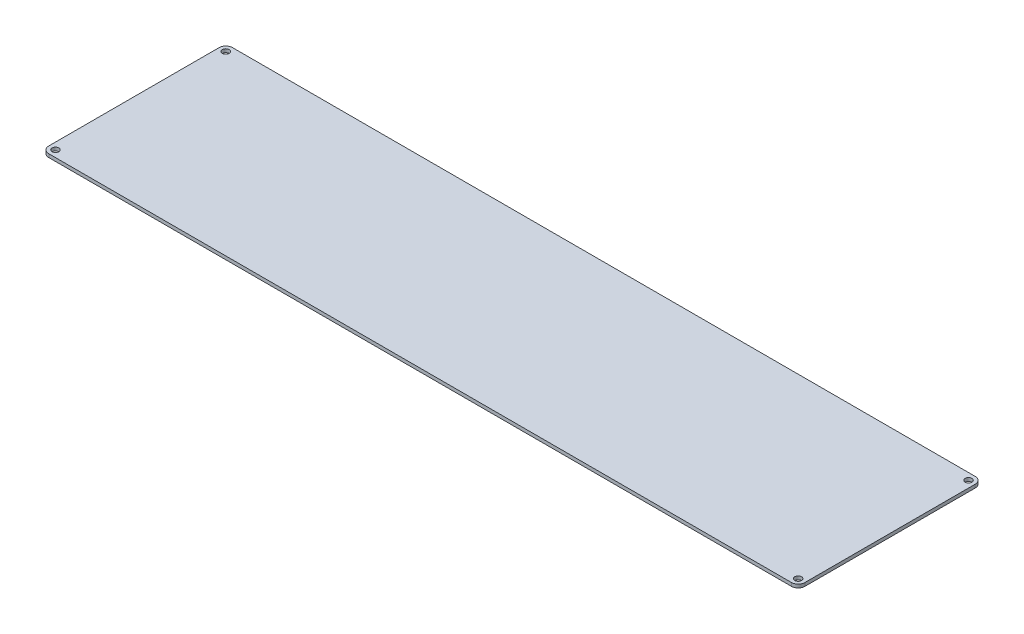
ISO-10303-21;
HEADER;
FILE_DESCRIPTION(('STEP AP214'),'2;1');
FILE_NAME('part.step','',(''),(''),'','','');
FILE_SCHEMA(('AUTOMOTIVE_DESIGN { 1 0 10303 214 1 1 1 1 }'));
ENDSEC;
DATA;
#1=APPLICATION_CONTEXT('core data for automotive mechanical design processes');
#2=APPLICATION_PROTOCOL_DEFINITION('international standard','automotive_design',2000,#1);
#3=PRODUCT_CONTEXT('',#1,'mechanical');
#4=PRODUCT('Part','Part','',(#3));
#5=PRODUCT_RELATED_PRODUCT_CATEGORY('part','',(#4));
#6=PRODUCT_DEFINITION_FORMATION('','',#4);
#7=PRODUCT_DEFINITION_CONTEXT('part definition',#1,'design');
#8=PRODUCT_DEFINITION('design','',#6,#7);
#9=PRODUCT_DEFINITION_SHAPE('','',#8);
#10=(LENGTH_UNIT() NAMED_UNIT(*) SI_UNIT(.MILLI.,.METRE.));
#11=(NAMED_UNIT(*) PLANE_ANGLE_UNIT() SI_UNIT($,.RADIAN.));
#12=(NAMED_UNIT(*) SI_UNIT($,.STERADIAN.) SOLID_ANGLE_UNIT());
#13=UNCERTAINTY_MEASURE_WITH_UNIT(LENGTH_MEASURE(1.E-05),#10,'distance_accuracy_value','');
#14=(GEOMETRIC_REPRESENTATION_CONTEXT(3) GLOBAL_UNCERTAINTY_ASSIGNED_CONTEXT((#13)) GLOBAL_UNIT_ASSIGNED_CONTEXT((#10,
#11,#12)) REPRESENTATION_CONTEXT('',''));
#15=CARTESIAN_POINT('',(0.,0.,0.));
#16=DIRECTION('',(0.,0.,1.));
#17=DIRECTION('',(1.,0.,0.));
#18=AXIS2_PLACEMENT_3D('',#15,#16,#17);
#19=CARTESIAN_POINT('',(333.951461861864,-3.175,0.));
#20=DIRECTION('',(-1.,0.,0.));
#21=DIRECTION('',(0.,0.,1.));
#22=AXIS2_PLACEMENT_3D('',#19,#20,#21);
#23=PLANE('',#22);
#24=DIRECTION('',(0.,0.,1.));
#25=VECTOR('',#24,1.);
#26=CARTESIAN_POINT('',(333.951461861864,0.,0.));
#27=LINE('',#26,#25);
#28=CARTESIAN_POINT('',(333.951461861864,0.,-192.647050824412));
#29=VERTEX_POINT('',#28);
#30=CARTESIAN_POINT('',(333.951461861864,0.,-31.8650508244125));
#31=VERTEX_POINT('',#30);
#32=EDGE_CURVE('E127',#29,#31,#27,.T.);
#33=ORIENTED_EDGE('',*,*,#32,.T.);
#34=DIRECTION('',(0.,1.,0.));
#35=VECTOR('',#34,1.);
#36=CARTESIAN_POINT('',(333.951461861864,-3.175,-31.8650508244125));
#37=LINE('',#36,#35);
#38=CARTESIAN_POINT('',(333.951461861864,-3.175,-31.8650508244125));
#39=VERTEX_POINT('',#38);
#40=EDGE_CURVE('E11',#31,#39,#37,.F.);
#41=ORIENTED_EDGE('',*,*,#40,.T.);
#42=DIRECTION('',(0.,0.,1.));
#43=VECTOR('',#42,1.);
#44=CARTESIAN_POINT('',(333.951461861864,-3.175,0.));
#45=LINE('',#44,#43);
#46=CARTESIAN_POINT('',(333.951461861864,-3.175,-192.647050824412));
#47=VERTEX_POINT('',#46);
#48=EDGE_CURVE('E163',#47,#39,#45,.T.);
#49=ORIENTED_EDGE('',*,*,#48,.F.);
#50=DIRECTION('',(0.,1.,0.));
#51=VECTOR('',#50,1.);
#52=CARTESIAN_POINT('',(333.951461861864,-3.175,-192.647050824412));
#53=LINE('',#52,#51);
#54=EDGE_CURVE('E42',#47,#29,#53,.T.);
#55=ORIENTED_EDGE('',*,*,#54,.T.);
#56=EDGE_LOOP('',(#33,#41,#49,#55));
#57=FACE_BOUND('',#56,.T.);
#58=ADVANCED_FACE('F34',(#57),#23,.F.);
#59=CARTESIAN_POINT('',(0.,-3.175,-25.5150508244125));
#60=DIRECTION('',(0.,0.,1.));
#61=DIRECTION('',(1.,0.,0.));
#62=AXIS2_PLACEMENT_3D('',#59,#60,#61);
#63=PLANE('',#62);
#64=DIRECTION('',(1.,0.,0.));
#65=VECTOR('',#64,1.);
#66=CARTESIAN_POINT('',(0.,0.,-25.5150508244125));
#67=LINE('',#66,#65);
#68=CARTESIAN_POINT('',(-373.489555790705,0.,-25.5150508244125));
#69=VERTEX_POINT('',#68);
#70=CARTESIAN_POINT('',(327.601461861864,0.,-25.5150508244125));
#71=VERTEX_POINT('',#70);
#72=EDGE_CURVE('E129',#69,#71,#67,.T.);
#73=ORIENTED_EDGE('',*,*,#72,.F.);
#74=DIRECTION('',(0.,1.,0.));
#75=VECTOR('',#74,1.);
#76=CARTESIAN_POINT('',(-373.489555790705,-3.175,-25.5150508244125));
#77=LINE('',#76,#75);
#78=CARTESIAN_POINT('',(-373.489555790705,-3.175,-25.5150508244125));
#79=VERTEX_POINT('',#78);
#80=EDGE_CURVE('E56',#69,#79,#77,.F.);
#81=ORIENTED_EDGE('',*,*,#80,.T.);
#82=DIRECTION('',(1.,0.,0.));
#83=VECTOR('',#82,1.);
#84=CARTESIAN_POINT('',(0.,-3.175,-25.5150508244125));
#85=LINE('',#84,#83);
#86=CARTESIAN_POINT('',(327.601461861864,-3.175,-25.5150508244125));
#87=VERTEX_POINT('',#86);
#88=EDGE_CURVE('E139',#79,#87,#85,.T.);
#89=ORIENTED_EDGE('',*,*,#88,.T.);
#90=DIRECTION('',(0.,1.,0.));
#91=VECTOR('',#90,1.);
#92=CARTESIAN_POINT('',(327.601461861864,0.,-25.5150508244125));
#93=LINE('',#92,#91);
#94=EDGE_CURVE('E155',#87,#71,#93,.T.);
#95=ORIENTED_EDGE('',*,*,#94,.T.);
#96=EDGE_LOOP('',(#73,#81,#89,#95));
#97=FACE_BOUND('',#96,.T.);
#98=ADVANCED_FACE('F169',(#97),#63,.T.);
#99=CARTESIAN_POINT('',(-379.839555790705,-3.175,0.));
#100=DIRECTION('',(-1.,0.,0.));
#101=DIRECTION('',(0.,0.,1.));
#102=AXIS2_PLACEMENT_3D('',#99,#100,#101);
#103=PLANE('',#102);
#104=DIRECTION('',(0.,0.,1.));
#105=VECTOR('',#104,1.);
#106=CARTESIAN_POINT('',(-379.839555790705,0.,0.));
#107=LINE('',#106,#105);
#108=CARTESIAN_POINT('',(-379.839555790705,0.,-192.647050824412));
#109=VERTEX_POINT('',#108);
#110=CARTESIAN_POINT('',(-379.839555790705,0.,-31.8650508244125));
#111=VERTEX_POINT('',#110);
#112=EDGE_CURVE('E126',#109,#111,#107,.T.);
#113=ORIENTED_EDGE('',*,*,#112,.F.);
#114=DIRECTION('',(0.,1.,0.));
#115=VECTOR('',#114,1.);
#116=CARTESIAN_POINT('',(-379.839555790705,-3.175,-192.647050824412));
#117=LINE('',#116,#115);
#118=CARTESIAN_POINT('',(-379.839555790705,-3.175,-192.647050824412));
#119=VERTEX_POINT('',#118);
#120=EDGE_CURVE('E105',#109,#119,#117,.F.);
#121=ORIENTED_EDGE('',*,*,#120,.T.);
#122=DIRECTION('',(0.,0.,1.));
#123=VECTOR('',#122,1.);
#124=CARTESIAN_POINT('',(-379.839555790705,-3.175,0.));
#125=LINE('',#124,#123);
#126=CARTESIAN_POINT('',(-379.839555790705,-3.175,-31.8650508244125));
#127=VERTEX_POINT('',#126);
#128=EDGE_CURVE('E171',#119,#127,#125,.T.);
#129=ORIENTED_EDGE('',*,*,#128,.T.);
#130=DIRECTION('',(0.,1.,0.));
#131=VECTOR('',#130,1.);
#132=CARTESIAN_POINT('',(-379.839555790705,-3.175,-31.8650508244125));
#133=LINE('',#132,#131);
#134=EDGE_CURVE('E110',#127,#111,#133,.T.);
#135=ORIENTED_EDGE('',*,*,#134,.T.);
#136=EDGE_LOOP('',(#113,#121,#129,#135));
#137=FACE_BOUND('',#136,.T.);
#138=ADVANCED_FACE('F210',(#137),#103,.T.);
#139=CARTESIAN_POINT('',(-373.489555790705,-3.175,-192.647050824412));
#140=DIRECTION('',(0.,1.,0.));
#141=DIRECTION('',(0.,0.,1.));
#142=AXIS2_PLACEMENT_3D('',#139,#140,#141);
#143=CYLINDRICAL_SURFACE('',#142,3.17499999999997);
#144=CARTESIAN_POINT('',(-373.489555790705,-3.175,-192.647050824412));
#145=DIRECTION('',(0.,1.,0.));
#146=DIRECTION('',(0.,0.,1.));
#147=AXIS2_PLACEMENT_3D('',#144,#145,#146);
#148=CIRCLE('',#147,3.17499999999997);
#149=CARTESIAN_POINT('',(-373.489555790705,-3.175,-189.472050824412));
#150=VERTEX_POINT('',#149);
#151=EDGE_CURVE('E238',#150,#150,#148,.T.);
#152=ORIENTED_EDGE('',*,*,#151,.F.);
#153=EDGE_LOOP('',(#152));
#154=FACE_BOUND('',#153,.T.);
#155=CARTESIAN_POINT('',(-373.489555790705,0.,-192.647050824412));
#156=DIRECTION('',(0.,1.,0.));
#157=DIRECTION('',(0.,0.,1.));
#158=AXIS2_PLACEMENT_3D('',#155,#156,#157);
#159=CIRCLE('',#158,3.17499999999997);
#160=CARTESIAN_POINT('',(-373.489555790705,0.,-189.472050824412));
#161=VERTEX_POINT('',#160);
#162=EDGE_CURVE('E132',#161,#161,#159,.T.);
#163=ORIENTED_EDGE('',*,*,#162,.T.);
#164=EDGE_LOOP('',(#163));
#165=FACE_BOUND('',#164,.T.);
#166=ADVANCED_FACE('F188',(#154,#165),#143,.F.);
#167=CARTESIAN_POINT('',(-373.489555790705,-3.175,-31.8650508244125));
#168=DIRECTION('',(0.,1.,0.));
#169=DIRECTION('',(0.,0.,1.));
#170=AXIS2_PLACEMENT_3D('',#167,#168,#169);
#171=CYLINDRICAL_SURFACE('',#170,3.17499999999997);
#172=CARTESIAN_POINT('',(-373.489555790705,-3.175,-31.8650508244125));
#173=DIRECTION('',(0.,1.,0.));
#174=DIRECTION('',(0.,0.,1.));
#175=AXIS2_PLACEMENT_3D('',#172,#173,#174);
#176=CIRCLE('',#175,3.17499999999997);
#177=CARTESIAN_POINT('',(-373.489555790705,-3.175,-28.6900508244125));
#178=VERTEX_POINT('',#177);
#179=EDGE_CURVE('E243',#178,#178,#176,.T.);
#180=ORIENTED_EDGE('',*,*,#179,.F.);
#181=EDGE_LOOP('',(#180));
#182=FACE_BOUND('',#181,.T.);
#183=CARTESIAN_POINT('',(-373.489555790705,0.,-31.8650508244125));
#184=DIRECTION('',(0.,1.,0.));
#185=DIRECTION('',(0.,0.,1.));
#186=AXIS2_PLACEMENT_3D('',#183,#184,#185);
#187=CIRCLE('',#186,3.17499999999997);
#188=CARTESIAN_POINT('',(-373.489555790705,0.,-28.6900508244125));
#189=VERTEX_POINT('',#188);
#190=EDGE_CURVE('E183',#189,#189,#187,.T.);
#191=ORIENTED_EDGE('',*,*,#190,.T.);
#192=EDGE_LOOP('',(#191));
#193=FACE_BOUND('',#192,.T.);
#194=ADVANCED_FACE('F216',(#182,#193),#171,.F.);
#195=CARTESIAN_POINT('',(327.601461861864,-3.175,-31.8650508244125));
#196=DIRECTION('',(0.,1.,0.));
#197=DIRECTION('',(0.,0.,1.));
#198=AXIS2_PLACEMENT_3D('',#195,#196,#197);
#199=CYLINDRICAL_SURFACE('',#198,3.17499999999997);
#200=CARTESIAN_POINT('',(327.601461861864,-3.175,-31.8650508244125));
#201=DIRECTION('',(0.,1.,0.));
#202=DIRECTION('',(0.,0.,1.));
#203=AXIS2_PLACEMENT_3D('',#200,#201,#202);
#204=CIRCLE('',#203,3.17499999999997);
#205=CARTESIAN_POINT('',(327.601461861864,-3.175,-28.6900508244125));
#206=VERTEX_POINT('',#205);
#207=EDGE_CURVE('E246',#206,#206,#204,.T.);
#208=ORIENTED_EDGE('',*,*,#207,.F.);
#209=EDGE_LOOP('',(#208));
#210=FACE_BOUND('',#209,.T.);
#211=CARTESIAN_POINT('',(327.601461861864,0.,-31.8650508244125));
#212=DIRECTION('',(0.,1.,0.));
#213=DIRECTION('',(0.,0.,1.));
#214=AXIS2_PLACEMENT_3D('',#211,#212,#213);
#215=CIRCLE('',#214,3.17499999999997);
#216=CARTESIAN_POINT('',(327.601461861864,0.,-28.6900508244125));
#217=VERTEX_POINT('',#216);
#218=EDGE_CURVE('E180',#217,#217,#215,.T.);
#219=ORIENTED_EDGE('',*,*,#218,.T.);
#220=EDGE_LOOP('',(#219));
#221=FACE_BOUND('',#220,.T.);
#222=ADVANCED_FACE('F220',(#210,#221),#199,.F.);
#223=CARTESIAN_POINT('',(327.601461861864,-3.175,-192.647050824412));
#224=DIRECTION('',(0.,1.,0.));
#225=DIRECTION('',(0.,0.,1.));
#226=AXIS2_PLACEMENT_3D('',#223,#224,#225);
#227=CYLINDRICAL_SURFACE('',#226,3.17499999999997);
#228=CARTESIAN_POINT('',(327.601461861864,-3.175,-192.647050824412));
#229=DIRECTION('',(0.,1.,0.));
#230=DIRECTION('',(0.,0.,1.));
#231=AXIS2_PLACEMENT_3D('',#228,#229,#230);
#232=CIRCLE('',#231,3.17499999999997);
#233=CARTESIAN_POINT('',(327.601461861864,-3.175,-189.472050824412));
#234=VERTEX_POINT('',#233);
#235=EDGE_CURVE('E138',#234,#234,#232,.T.);
#236=ORIENTED_EDGE('',*,*,#235,.F.);
#237=EDGE_LOOP('',(#236));
#238=FACE_BOUND('',#237,.T.);
#239=CARTESIAN_POINT('',(327.601461861864,0.,-192.647050824412));
#240=DIRECTION('',(0.,1.,0.));
#241=DIRECTION('',(0.,0.,1.));
#242=AXIS2_PLACEMENT_3D('',#239,#240,#241);
#243=CIRCLE('',#242,3.17499999999997);
#244=CARTESIAN_POINT('',(327.601461861864,0.,-189.472050824412));
#245=VERTEX_POINT('',#244);
#246=EDGE_CURVE('E177',#245,#245,#243,.T.);
#247=ORIENTED_EDGE('',*,*,#246,.T.);
#248=EDGE_LOOP('',(#247));
#249=FACE_BOUND('',#248,.T.);
#250=ADVANCED_FACE('F224',(#238,#249),#227,.F.);
#251=CARTESIAN_POINT('',(0.,-3.175,-198.997050824412));
#252=DIRECTION('',(0.,0.,1.));
#253=DIRECTION('',(1.,0.,0.));
#254=AXIS2_PLACEMENT_3D('',#251,#252,#253);
#255=PLANE('',#254);
#256=DIRECTION('',(1.,0.,0.));
#257=VECTOR('',#256,1.);
#258=CARTESIAN_POINT('',(0.,-3.175,-198.997050824412));
#259=LINE('',#258,#257);
#260=CARTESIAN_POINT('',(-373.489555790705,-3.175,-198.997050824412));
#261=VERTEX_POINT('',#260);
#262=CARTESIAN_POINT('',(327.601461861864,-3.175,-198.997050824412));
#263=VERTEX_POINT('',#262);
#264=EDGE_CURVE('E120',#261,#263,#259,.T.);
#265=ORIENTED_EDGE('',*,*,#264,.F.);
#266=DIRECTION('',(0.,1.,0.));
#267=VECTOR('',#266,1.);
#268=CARTESIAN_POINT('',(-373.489555790705,0.,-198.997050824412));
#269=LINE('',#268,#267);
#270=CARTESIAN_POINT('',(-373.489555790705,0.,-198.997050824412));
#271=VERTEX_POINT('',#270);
#272=EDGE_CURVE('E104',#261,#271,#269,.T.);
#273=ORIENTED_EDGE('',*,*,#272,.T.);
#274=DIRECTION('',(1.,0.,0.));
#275=VECTOR('',#274,1.);
#276=CARTESIAN_POINT('',(0.,0.,-198.997050824412));
#277=LINE('',#276,#275);
#278=CARTESIAN_POINT('',(327.601461861864,0.,-198.997050824412));
#279=VERTEX_POINT('',#278);
#280=EDGE_CURVE('E117',#271,#279,#277,.T.);
#281=ORIENTED_EDGE('',*,*,#280,.T.);
#282=DIRECTION('',(0.,1.,0.));
#283=VECTOR('',#282,1.);
#284=CARTESIAN_POINT('',(327.601461861864,-3.175,-198.997050824412));
#285=LINE('',#284,#283);
#286=EDGE_CURVE('E122',#279,#263,#285,.F.);
#287=ORIENTED_EDGE('',*,*,#286,.T.);
#288=EDGE_LOOP('',(#265,#273,#281,#287));
#289=FACE_BOUND('',#288,.T.);
#290=ADVANCED_FACE('F116',(#289),#255,.F.);
#291=CARTESIAN_POINT('',(0.,-3.175,0.));
#292=DIRECTION('',(0.,1.,0.));
#293=DIRECTION('',(0.,0.,1.));
#294=AXIS2_PLACEMENT_3D('',#291,#292,#293);
#295=PLANE('',#294);
#296=ORIENTED_EDGE('',*,*,#235,.T.);
#297=EDGE_LOOP('',(#296));
#298=FACE_BOUND('',#297,.T.);
#299=ORIENTED_EDGE('',*,*,#207,.T.);
#300=EDGE_LOOP('',(#299));
#301=FACE_BOUND('',#300,.T.);
#302=ORIENTED_EDGE('',*,*,#179,.T.);
#303=EDGE_LOOP('',(#302));
#304=FACE_BOUND('',#303,.T.);
#305=ORIENTED_EDGE('',*,*,#151,.T.);
#306=EDGE_LOOP('',(#305));
#307=FACE_BOUND('',#306,.T.);
#308=ORIENTED_EDGE('',*,*,#128,.F.);
#309=CARTESIAN_POINT('',(-373.489555790705,-3.175,-192.647050824412));
#310=DIRECTION('',(0.,1.,0.));
#311=DIRECTION('',(0.,0.,1.));
#312=AXIS2_PLACEMENT_3D('',#309,#310,#311);
#313=CIRCLE('',#312,6.35);
#314=EDGE_CURVE('E153',#119,#261,#313,.F.);
#315=ORIENTED_EDGE('',*,*,#314,.T.);
#316=ORIENTED_EDGE('',*,*,#264,.T.);
#317=CARTESIAN_POINT('',(327.601461861864,-3.175,-192.647050824412));
#318=DIRECTION('',(0.,1.,0.));
#319=DIRECTION('',(0.,0.,1.));
#320=AXIS2_PLACEMENT_3D('',#317,#318,#319);
#321=CIRCLE('',#320,6.35);
#322=EDGE_CURVE('E148',#263,#47,#321,.F.);
#323=ORIENTED_EDGE('',*,*,#322,.T.);
#324=ORIENTED_EDGE('',*,*,#48,.T.);
#325=CARTESIAN_POINT('',(327.601461861864,-3.175,-31.8650508244125));
#326=DIRECTION('',(0.,1.,0.));
#327=DIRECTION('',(0.,0.,1.));
#328=AXIS2_PLACEMENT_3D('',#325,#326,#327);
#329=CIRCLE('',#328,6.35);
#330=EDGE_CURVE('E49',#39,#87,#329,.F.);
#331=ORIENTED_EDGE('',*,*,#330,.T.);
#332=ORIENTED_EDGE('',*,*,#88,.F.);
#333=CARTESIAN_POINT('',(-373.489555790705,-3.175,-31.8650508244125));
#334=DIRECTION('',(0.,1.,0.));
#335=DIRECTION('',(0.,0.,1.));
#336=AXIS2_PLACEMENT_3D('',#333,#334,#335);
#337=CIRCLE('',#336,6.35);
#338=EDGE_CURVE('E151',#79,#127,#337,.F.);
#339=ORIENTED_EDGE('',*,*,#338,.T.);
#340=EDGE_LOOP('',(#308,#315,#316,#323,#324,#331,#332,#339));
#341=FACE_BOUND('',#340,.T.);
#342=ADVANCED_FACE('F191',(#298,#301,#304,#307,#341),#295,.F.);
#343=CARTESIAN_POINT('',(0.,0.,0.));
#344=DIRECTION('',(0.,1.,0.));
#345=DIRECTION('',(0.,0.,1.));
#346=AXIS2_PLACEMENT_3D('',#343,#344,#345);
#347=PLANE('',#346);
#348=ORIENTED_EDGE('',*,*,#246,.F.);
#349=EDGE_LOOP('',(#348));
#350=FACE_BOUND('',#349,.T.);
#351=ORIENTED_EDGE('',*,*,#218,.F.);
#352=EDGE_LOOP('',(#351));
#353=FACE_BOUND('',#352,.T.);
#354=ORIENTED_EDGE('',*,*,#190,.F.);
#355=EDGE_LOOP('',(#354));
#356=FACE_BOUND('',#355,.T.);
#357=ORIENTED_EDGE('',*,*,#162,.F.);
#358=EDGE_LOOP('',(#357));
#359=FACE_BOUND('',#358,.T.);
#360=ORIENTED_EDGE('',*,*,#280,.F.);
#361=CARTESIAN_POINT('',(-373.489555790705,0.,-192.647050824412));
#362=DIRECTION('',(0.,1.,0.));
#363=DIRECTION('',(0.,0.,1.));
#364=AXIS2_PLACEMENT_3D('',#361,#362,#363);
#365=CIRCLE('',#364,6.35);
#366=EDGE_CURVE('E100',#271,#109,#365,.T.);
#367=ORIENTED_EDGE('',*,*,#366,.T.);
#368=ORIENTED_EDGE('',*,*,#112,.T.);
#369=CARTESIAN_POINT('',(-373.489555790705,0.,-31.8650508244125));
#370=DIRECTION('',(0.,1.,0.));
#371=DIRECTION('',(0.,0.,1.));
#372=AXIS2_PLACEMENT_3D('',#369,#370,#371);
#373=CIRCLE('',#372,6.35);
#374=EDGE_CURVE('E111',#111,#69,#373,.T.);
#375=ORIENTED_EDGE('',*,*,#374,.T.);
#376=ORIENTED_EDGE('',*,*,#72,.T.);
#377=CARTESIAN_POINT('',(327.601461861864,0.,-31.8650508244125));
#378=DIRECTION('',(0.,1.,0.));
#379=DIRECTION('',(0.,0.,1.));
#380=AXIS2_PLACEMENT_3D('',#377,#378,#379);
#381=CIRCLE('',#380,6.35);
#382=EDGE_CURVE('E142',#71,#31,#381,.T.);
#383=ORIENTED_EDGE('',*,*,#382,.T.);
#384=ORIENTED_EDGE('',*,*,#32,.F.);
#385=CARTESIAN_POINT('',(327.601461861864,0.,-192.647050824412));
#386=DIRECTION('',(0.,1.,0.));
#387=DIRECTION('',(0.,0.,1.));
#388=AXIS2_PLACEMENT_3D('',#385,#386,#387);
#389=CIRCLE('',#388,6.35);
#390=EDGE_CURVE('E121',#29,#279,#389,.T.);
#391=ORIENTED_EDGE('',*,*,#390,.T.);
#392=EDGE_LOOP('',(#360,#367,#368,#375,#376,#383,#384,#391));
#393=FACE_BOUND('',#392,.T.);
#394=ADVANCED_FACE('F124',(#350,#353,#356,#359,#393),#347,.T.);
#395=CARTESIAN_POINT('',(-373.489555790705,-3.175,-192.647050824412));
#396=DIRECTION('',(0.,-1.,0.));
#397=DIRECTION('',(0.,0.,-1.));
#398=AXIS2_PLACEMENT_3D('',#395,#396,#397);
#399=CYLINDRICAL_SURFACE('',#398,6.35);
#400=ORIENTED_EDGE('',*,*,#314,.F.);
#401=ORIENTED_EDGE('',*,*,#120,.F.);
#402=ORIENTED_EDGE('',*,*,#366,.F.);
#403=ORIENTED_EDGE('',*,*,#272,.F.);
#404=EDGE_LOOP('',(#400,#401,#402,#403));
#405=FACE_BOUND('',#404,.T.);
#406=ADVANCED_FACE('F103',(#405),#399,.T.);
#407=CARTESIAN_POINT('',(-373.489555790705,-3.175,-31.8650508244125));
#408=DIRECTION('',(0.,1.,0.));
#409=DIRECTION('',(0.,0.,1.));
#410=AXIS2_PLACEMENT_3D('',#407,#408,#409);
#411=CYLINDRICAL_SURFACE('',#410,6.35);
#412=ORIENTED_EDGE('',*,*,#338,.F.);
#413=ORIENTED_EDGE('',*,*,#80,.F.);
#414=ORIENTED_EDGE('',*,*,#374,.F.);
#415=ORIENTED_EDGE('',*,*,#134,.F.);
#416=EDGE_LOOP('',(#412,#413,#414,#415));
#417=FACE_BOUND('',#416,.T.);
#418=ADVANCED_FACE('F198',(#417),#411,.T.);
#419=CARTESIAN_POINT('',(327.601461861864,-3.175,-31.8650508244125));
#420=DIRECTION('',(0.,-1.,0.));
#421=DIRECTION('',(0.,0.,-1.));
#422=AXIS2_PLACEMENT_3D('',#419,#420,#421);
#423=CYLINDRICAL_SURFACE('',#422,6.35);
#424=ORIENTED_EDGE('',*,*,#330,.F.);
#425=ORIENTED_EDGE('',*,*,#40,.F.);
#426=ORIENTED_EDGE('',*,*,#382,.F.);
#427=ORIENTED_EDGE('',*,*,#94,.F.);
#428=EDGE_LOOP('',(#424,#425,#426,#427));
#429=FACE_BOUND('',#428,.T.);
#430=ADVANCED_FACE('F168',(#429),#423,.T.);
#431=CARTESIAN_POINT('',(327.601461861864,-3.175,-192.647050824412));
#432=DIRECTION('',(0.,1.,0.));
#433=DIRECTION('',(0.,0.,1.));
#434=AXIS2_PLACEMENT_3D('',#431,#432,#433);
#435=CYLINDRICAL_SURFACE('',#434,6.35);
#436=ORIENTED_EDGE('',*,*,#322,.F.);
#437=ORIENTED_EDGE('',*,*,#286,.F.);
#438=ORIENTED_EDGE('',*,*,#390,.F.);
#439=ORIENTED_EDGE('',*,*,#54,.F.);
#440=EDGE_LOOP('',(#436,#437,#438,#439));
#441=FACE_BOUND('',#440,.T.);
#442=ADVANCED_FACE('F36',(#441),#435,.T.);
#443=CLOSED_SHELL('',(#58,#98,#138,#166,#194,#222,#250,#290,#342,#394,#406,#418,#430,#442));
#444=MANIFOLD_SOLID_BREP('B2',#443);
#445=ADVANCED_BREP_SHAPE_REPRESENTATION('',(#18,#444),#14);
#446=SHAPE_DEFINITION_REPRESENTATION(#9,#445);
ENDSEC;
END-ISO-10303-21;
